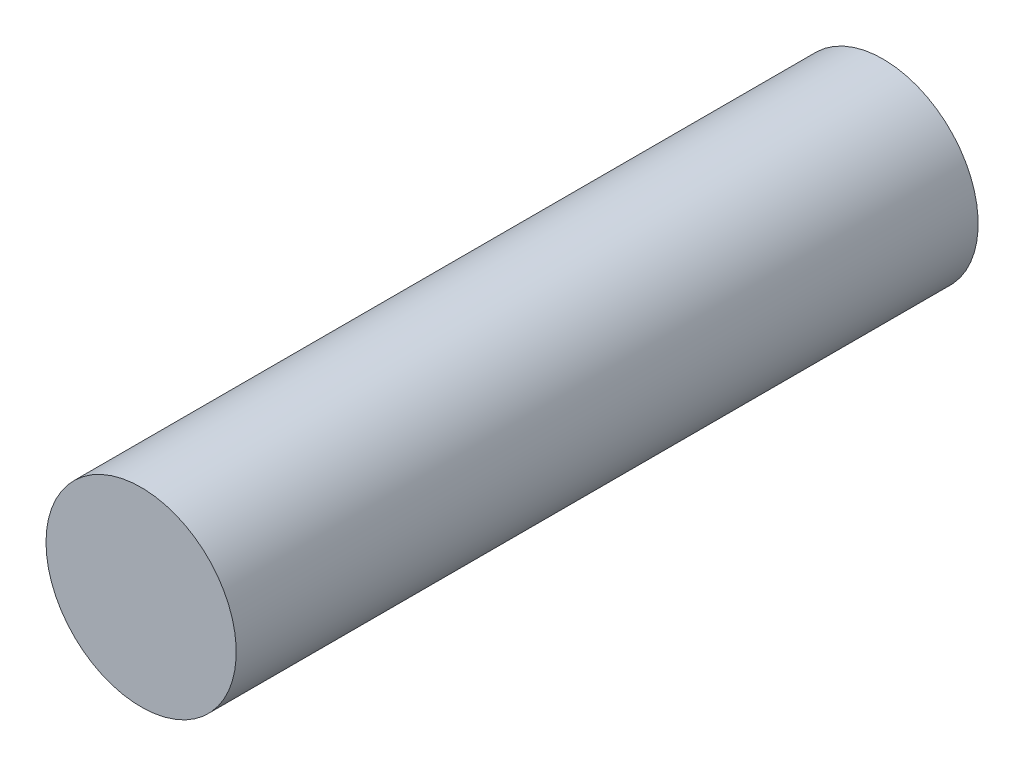
ISO-10303-21;
HEADER;
FILE_DESCRIPTION(('STEP AP214'),'2;1');
FILE_NAME('part.step','',(''),(''),'','','');
FILE_SCHEMA(('AUTOMOTIVE_DESIGN { 1 0 10303 214 1 1 1 1 }'));
ENDSEC;
DATA;
#1=APPLICATION_CONTEXT('core data for automotive mechanical design processes');
#2=APPLICATION_PROTOCOL_DEFINITION('international standard','automotive_design',2000,#1);
#3=PRODUCT_CONTEXT('',#1,'mechanical');
#4=PRODUCT('Part','Part','',(#3));
#5=PRODUCT_RELATED_PRODUCT_CATEGORY('part','',(#4));
#6=PRODUCT_DEFINITION_FORMATION('','',#4);
#7=PRODUCT_DEFINITION_CONTEXT('part definition',#1,'design');
#8=PRODUCT_DEFINITION('design','',#6,#7);
#9=PRODUCT_DEFINITION_SHAPE('','',#8);
#10=(LENGTH_UNIT() NAMED_UNIT(*) SI_UNIT(.MILLI.,.METRE.));
#11=(NAMED_UNIT(*) PLANE_ANGLE_UNIT() SI_UNIT($,.RADIAN.));
#12=(NAMED_UNIT(*) SI_UNIT($,.STERADIAN.) SOLID_ANGLE_UNIT());
#13=UNCERTAINTY_MEASURE_WITH_UNIT(LENGTH_MEASURE(1.E-05),#10,'distance_accuracy_value','');
#14=(GEOMETRIC_REPRESENTATION_CONTEXT(3) GLOBAL_UNCERTAINTY_ASSIGNED_CONTEXT((#13)) GLOBAL_UNIT_ASSIGNED_CONTEXT((#10,
#11,#12)) REPRESENTATION_CONTEXT('',''));
#15=CARTESIAN_POINT('',(0.,0.,0.));
#16=DIRECTION('',(0.,0.,1.));
#17=DIRECTION('',(1.,0.,0.));
#18=AXIS2_PLACEMENT_3D('',#15,#16,#17);
#19=CARTESIAN_POINT('',(0.0999998,0.,0.78000098));
#20=DIRECTION('',(0.,0.,-1.));
#21=DIRECTION('',(0.,-1.,0.));
#22=AXIS2_PLACEMENT_3D('',#19,#20,#21);
#23=PLANE('',#22);
#24=CARTESIAN_POINT('',(0.,0.,0.78000098));
#25=DIRECTION('',(0.,0.,1.));
#26=DIRECTION('',(1.,0.,0.));
#27=AXIS2_PLACEMENT_3D('',#24,#25,#26);
#28=CIRCLE('',#27,0.0999998);
#29=CARTESIAN_POINT('',(-0.0999998,0.,0.78000098));
#30=VERTEX_POINT('',#29);
#31=EDGE_CURVE('E11',#30,#30,#28,.T.);
#32=ORIENTED_EDGE('',*,*,#31,.T.);
#33=EDGE_LOOP('',(#32));
#34=FACE_BOUND('',#33,.T.);
#35=ADVANCED_FACE('F17',(#34),#23,.F.);
#36=CARTESIAN_POINT('',(0.0999998,0.,0.));
#37=DIRECTION('',(0.,0.,-1.));
#38=DIRECTION('',(0.,-1.,0.));
#39=AXIS2_PLACEMENT_3D('',#36,#37,#38);
#40=PLANE('',#39);
#41=CARTESIAN_POINT('',(0.,0.,0.));
#42=DIRECTION('',(0.,0.,1.));
#43=DIRECTION('',(1.,0.,0.));
#44=AXIS2_PLACEMENT_3D('',#41,#42,#43);
#45=CIRCLE('',#44,0.0999998);
#46=CARTESIAN_POINT('',(-0.0999998,0.,0.));
#47=VERTEX_POINT('',#46);
#48=EDGE_CURVE('E42',#47,#47,#45,.T.);
#49=ORIENTED_EDGE('',*,*,#48,.F.);
#50=EDGE_LOOP('',(#49));
#51=FACE_BOUND('',#50,.T.);
#52=ADVANCED_FACE('F61',(#51),#40,.T.);
#53=CARTESIAN_POINT('',(0.,0.,0.));
#54=DIRECTION('',(0.,0.,-1.));
#55=DIRECTION('',(1.,0.,0.));
#56=AXIS2_PLACEMENT_3D('',#53,#54,#55);
#57=CYLINDRICAL_SURFACE('',#56,0.0999998);
#58=ORIENTED_EDGE('',*,*,#48,.T.);
#59=DIRECTION('',(0.,0.,1.));
#60=VECTOR('',#59,1.);
#61=CARTESIAN_POINT('',(-0.0999998,0.,0.));
#62=LINE('',#61,#60);
#63=EDGE_CURVE('E25',#47,#30,#62,.T.);
#64=ORIENTED_EDGE('',*,*,#63,.T.);
#65=ORIENTED_EDGE('',*,*,#31,.F.);
#66=ORIENTED_EDGE('',*,*,#63,.F.);
#67=EDGE_LOOP('',(#58,#64,#65,#66));
#68=FACE_BOUND('',#67,.T.);
#69=ADVANCED_FACE('F40',(#68),#57,.T.);
#70=CLOSED_SHELL('',(#35,#52,#69));
#71=MANIFOLD_SOLID_BREP('B1',#70);
#72=ADVANCED_BREP_SHAPE_REPRESENTATION('',(#18,#71),#14);
#73=SHAPE_DEFINITION_REPRESENTATION(#9,#72);
ENDSEC;
END-ISO-10303-21;
